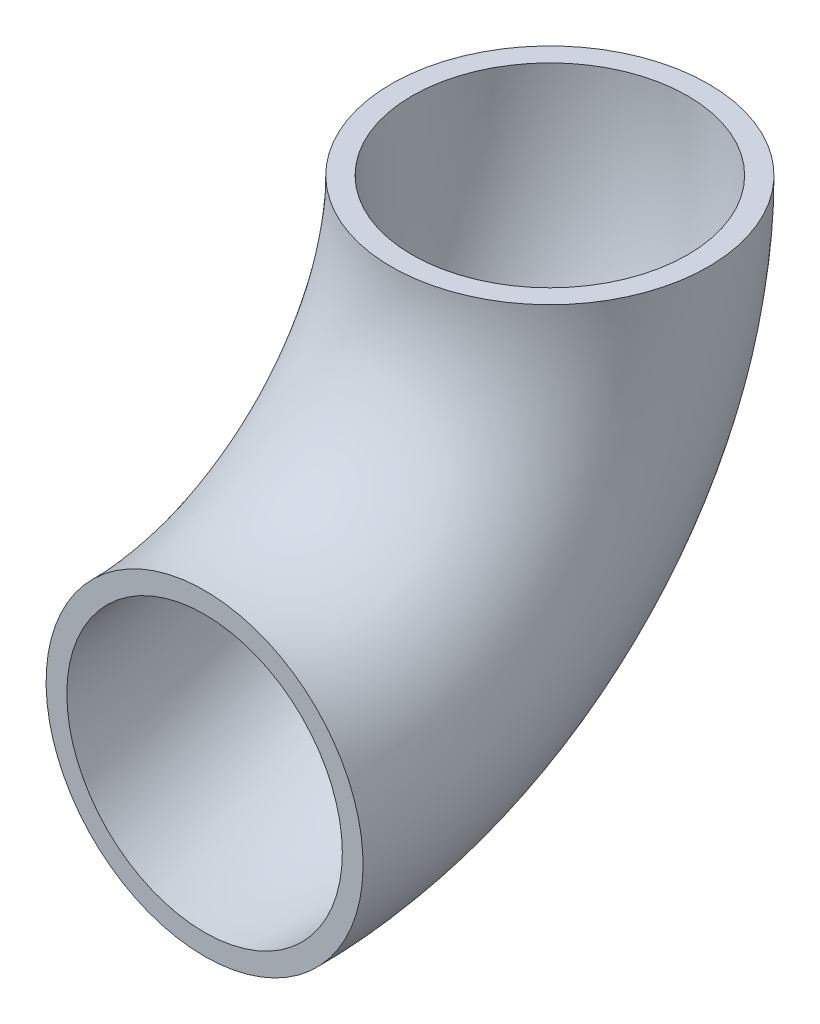
ISO-10303-21;
HEADER;
FILE_DESCRIPTION(('STEP AP214'),'2;1');
FILE_NAME('part.step','',(''),(''),'','','');
FILE_SCHEMA(('AUTOMOTIVE_DESIGN { 1 0 10303 214 1 1 1 1 }'));
ENDSEC;
DATA;
#1=APPLICATION_CONTEXT('core data for automotive mechanical design processes');
#2=APPLICATION_PROTOCOL_DEFINITION('international standard','automotive_design',2000,#1);
#3=PRODUCT_CONTEXT('',#1,'mechanical');
#4=PRODUCT('Part','Part','',(#3));
#5=PRODUCT_RELATED_PRODUCT_CATEGORY('part','',(#4));
#6=PRODUCT_DEFINITION_FORMATION('','',#4);
#7=PRODUCT_DEFINITION_CONTEXT('part definition',#1,'design');
#8=PRODUCT_DEFINITION('design','',#6,#7);
#9=PRODUCT_DEFINITION_SHAPE('','',#8);
#10=(LENGTH_UNIT() NAMED_UNIT(*) SI_UNIT(.MILLI.,.METRE.));
#11=(NAMED_UNIT(*) PLANE_ANGLE_UNIT() SI_UNIT($,.RADIAN.));
#12=(NAMED_UNIT(*) SI_UNIT($,.STERADIAN.) SOLID_ANGLE_UNIT());
#13=UNCERTAINTY_MEASURE_WITH_UNIT(LENGTH_MEASURE(1.E-05),#10,'distance_accuracy_value','');
#14=(GEOMETRIC_REPRESENTATION_CONTEXT(3) GLOBAL_UNCERTAINTY_ASSIGNED_CONTEXT((#13)) GLOBAL_UNIT_ASSIGNED_CONTEXT((#10,
#11,#12)) REPRESENTATION_CONTEXT('',''));
#15=CARTESIAN_POINT('',(0.,0.,0.));
#16=DIRECTION('',(0.,0.,1.));
#17=DIRECTION('',(1.,0.,0.));
#18=AXIS2_PLACEMENT_3D('',#15,#16,#17);
#19=CARTESIAN_POINT('',(0.,96.8375,0.));
#20=DIRECTION('',(-1.,0.,0.));
#21=DIRECTION('',(0.,0.,1.));
#22=AXIS2_PLACEMENT_3D('',#19,#20,#21);
#23=TOROIDAL_SURFACE('',#22,96.8375,38.6334);
#24=CARTESIAN_POINT('',(0.,96.8375000000003,-96.8375));
#25=DIRECTION('',(0.,-1.,0.));
#26=DIRECTION('',(1.,0.,0.));
#27=AXIS2_PLACEMENT_3D('',#24,#25,#26);
#28=CIRCLE('',#27,38.6334);
#29=CARTESIAN_POINT('',(0.,96.8375000000005,-135.4709));
#30=VERTEX_POINT('',#29);
#31=EDGE_CURVE('E37',#30,#30,#28,.T.);
#32=CARTESIAN_POINT('',(0.,0.,0.));
#33=DIRECTION('',(0.,0.,1.));
#34=DIRECTION('',(1.,0.,0.));
#35=AXIS2_PLACEMENT_3D('',#32,#33,#34);
#36=CIRCLE('',#35,38.6334);
#37=CARTESIAN_POINT('',(0.,-38.6334,0.));
#38=VERTEX_POINT('',#37);
#39=EDGE_CURVE('E45',#38,#38,#36,.T.);
#40=CARTESIAN_POINT('',(0.,96.8375,0.));
#41=DIRECTION('',(-1.,0.,0.));
#42=DIRECTION('',(0.,0.,1.));
#43=AXIS2_PLACEMENT_3D('',#40,#41,#42);
#44=CIRCLE('',#43,135.4709);
#45=EDGE_CURVE('',#30,#38,#44,.T.);
#46=ORIENTED_EDGE('',*,*,#31,.F.);
#47=ORIENTED_EDGE('',*,*,#39,.T.);
#48=ORIENTED_EDGE('',*,*,#45,.T.);
#49=ORIENTED_EDGE('',*,*,#45,.F.);
#50=EDGE_LOOP('',(#46,#48,#47,#49));
#51=FACE_BOUND('',#50,.T.);
#52=ADVANCED_FACE('F30',(#51),#23,.F.);
#53=CARTESIAN_POINT('',(0.,96.8375,0.));
#54=DIRECTION('',(-1.,0.,0.));
#55=DIRECTION('',(0.,0.,1.));
#56=AXIS2_PLACEMENT_3D('',#53,#54,#55);
#57=TOROIDAL_SURFACE('',#56,96.8375,44.45);
#58=CARTESIAN_POINT('',(0.,96.8375000000003,-96.8375));
#59=DIRECTION('',(0.,-1.,0.));
#60=DIRECTION('',(1.,0.,0.));
#61=AXIS2_PLACEMENT_3D('',#58,#59,#60);
#62=CIRCLE('',#61,44.45);
#63=CARTESIAN_POINT('',(0.,96.8375000000005,-141.2875));
#64=VERTEX_POINT('',#63);
#65=EDGE_CURVE('E10',#64,#64,#62,.T.);
#66=CARTESIAN_POINT('',(0.,0.,0.));
#67=DIRECTION('',(0.,0.,1.));
#68=DIRECTION('',(1.,0.,0.));
#69=AXIS2_PLACEMENT_3D('',#66,#67,#68);
#70=CIRCLE('',#69,44.45);
#71=CARTESIAN_POINT('',(0.,-44.45,0.));
#72=VERTEX_POINT('',#71);
#73=EDGE_CURVE('E41',#72,#72,#70,.T.);
#74=CARTESIAN_POINT('',(0.,96.8375,0.));
#75=DIRECTION('',(-1.,0.,0.));
#76=DIRECTION('',(0.,0.,1.));
#77=AXIS2_PLACEMENT_3D('',#74,#75,#76);
#78=CIRCLE('',#77,141.2875);
#79=EDGE_CURVE('',#64,#72,#78,.T.);
#80=ORIENTED_EDGE('',*,*,#65,.T.);
#81=ORIENTED_EDGE('',*,*,#73,.F.);
#82=ORIENTED_EDGE('',*,*,#79,.T.);
#83=ORIENTED_EDGE('',*,*,#79,.F.);
#84=EDGE_LOOP('',(#80,#82,#81,#83));
#85=FACE_BOUND('',#84,.T.);
#86=ADVANCED_FACE('F32',(#85),#57,.T.);
#87=CARTESIAN_POINT('',(0.,96.8375000000003,-96.8375));
#88=DIRECTION('',(0.,-1.,0.));
#89=DIRECTION('',(1.,0.,0.));
#90=AXIS2_PLACEMENT_3D('',#87,#88,#89);
#91=PLANE('',#90);
#92=ORIENTED_EDGE('',*,*,#31,.T.);
#93=EDGE_LOOP('',(#92));
#94=FACE_BOUND('',#93,.T.);
#95=ORIENTED_EDGE('',*,*,#65,.F.);
#96=EDGE_LOOP('',(#95));
#97=FACE_BOUND('',#96,.T.);
#98=ADVANCED_FACE('F55',(#94,#97),#91,.F.);
#99=CARTESIAN_POINT('',(0.,0.,0.));
#100=DIRECTION('',(0.,0.,1.));
#101=DIRECTION('',(1.,0.,0.));
#102=AXIS2_PLACEMENT_3D('',#99,#100,#101);
#103=PLANE('',#102);
#104=ORIENTED_EDGE('',*,*,#39,.F.);
#105=EDGE_LOOP('',(#104));
#106=FACE_BOUND('',#105,.T.);
#107=ORIENTED_EDGE('',*,*,#73,.T.);
#108=EDGE_LOOP('',(#107));
#109=FACE_BOUND('',#108,.T.);
#110=ADVANCED_FACE('F52',(#106,#109),#103,.T.);
#111=CLOSED_SHELL('',(#52,#86,#98,#110));
#112=MANIFOLD_SOLID_BREP('B2',#111);
#113=ADVANCED_BREP_SHAPE_REPRESENTATION('',(#18,#112),#14);
#114=SHAPE_DEFINITION_REPRESENTATION(#9,#113);
ENDSEC;
END-ISO-10303-21;
